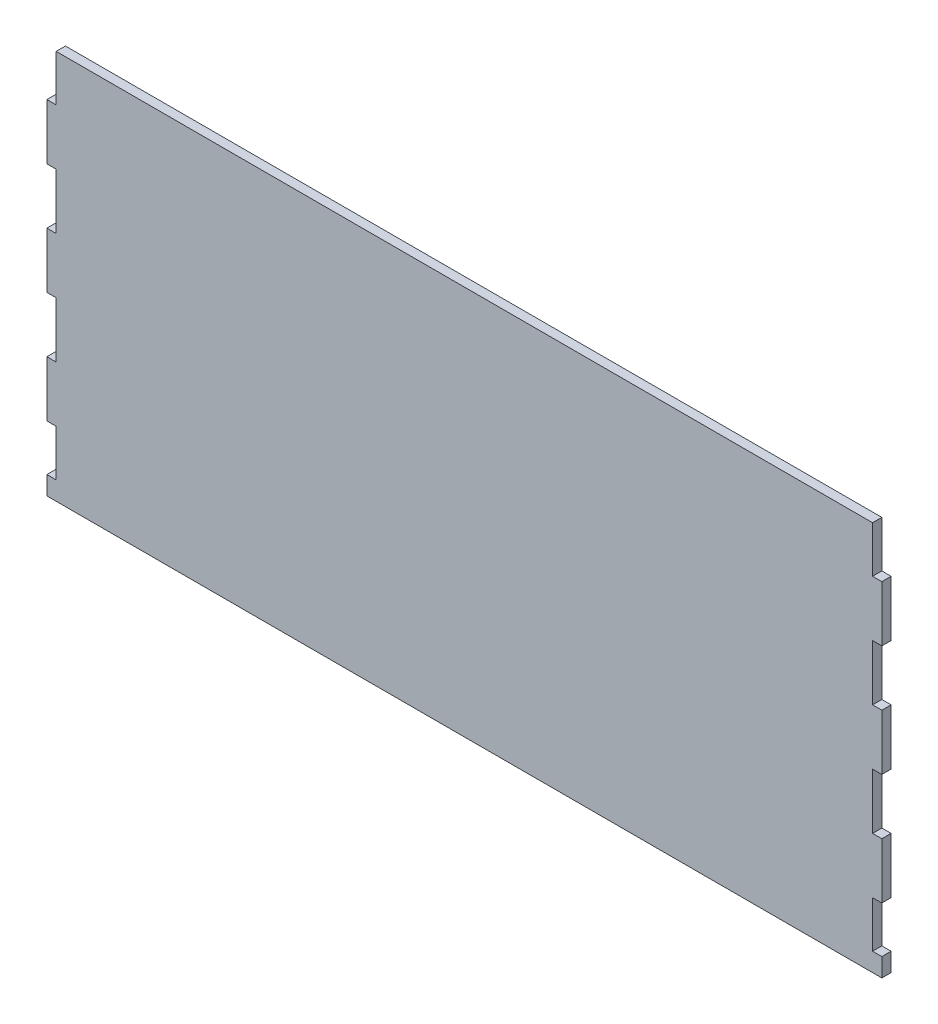
ISO-10303-21;
HEADER;
FILE_DESCRIPTION(('STEP AP214'),'2;1');
FILE_NAME('part.step','',(''),(''),'','','');
FILE_SCHEMA(('AUTOMOTIVE_DESIGN { 1 0 10303 214 1 1 1 1 }'));
ENDSEC;
DATA;
#1=APPLICATION_CONTEXT('core data for automotive mechanical design processes');
#2=APPLICATION_PROTOCOL_DEFINITION('international standard','automotive_design',2000,#1);
#3=PRODUCT_CONTEXT('',#1,'mechanical');
#4=PRODUCT('Part','Part','',(#3));
#5=PRODUCT_RELATED_PRODUCT_CATEGORY('part','',(#4));
#6=PRODUCT_DEFINITION_FORMATION('','',#4);
#7=PRODUCT_DEFINITION_CONTEXT('part definition',#1,'design');
#8=PRODUCT_DEFINITION('design','',#6,#7);
#9=PRODUCT_DEFINITION_SHAPE('','',#8);
#10=(LENGTH_UNIT() NAMED_UNIT(*) SI_UNIT(.MILLI.,.METRE.));
#11=(NAMED_UNIT(*) PLANE_ANGLE_UNIT() SI_UNIT($,.RADIAN.));
#12=(NAMED_UNIT(*) SI_UNIT($,.STERADIAN.) SOLID_ANGLE_UNIT());
#13=UNCERTAINTY_MEASURE_WITH_UNIT(LENGTH_MEASURE(1.E-05),#10,'distance_accuracy_value','');
#14=(GEOMETRIC_REPRESENTATION_CONTEXT(3) GLOBAL_UNCERTAINTY_ASSIGNED_CONTEXT((#13)) GLOBAL_UNIT_ASSIGNED_CONTEXT((#10,
#11,#12)) REPRESENTATION_CONTEXT('',''));
#15=CARTESIAN_POINT('',(0.,0.,0.));
#16=DIRECTION('',(0.,0.,1.));
#17=DIRECTION('',(1.,0.,0.));
#18=AXIS2_PLACEMENT_3D('',#15,#16,#17);
#19=CARTESIAN_POINT('',(225.,105.,5.));
#20=DIRECTION('',(-1.,0.,0.));
#21=DIRECTION('',(0.,-1.,0.));
#22=AXIS2_PLACEMENT_3D('',#19,#20,#21);
#23=PLANE('',#22);
#24=DIRECTION('',(0.,1.,0.));
#25=VECTOR('',#24,1.);
#26=CARTESIAN_POINT('',(225.,105.,0.));
#27=LINE('',#26,#25);
#28=CARTESIAN_POINT('',(225.,-105.,0.));
#29=VERTEX_POINT('',#28);
#30=CARTESIAN_POINT('',(225.,-95.,0.));
#31=VERTEX_POINT('',#30);
#32=EDGE_CURVE('E530',#29,#31,#27,.T.);
#33=ORIENTED_EDGE('',*,*,#32,.T.);
#34=DIRECTION('',(0.,0.,1.));
#35=VECTOR('',#34,1.);
#36=CARTESIAN_POINT('',(225.,-95.,5.));
#37=LINE('',#36,#35);
#38=CARTESIAN_POINT('',(225.,-95.,5.));
#39=VERTEX_POINT('',#38);
#40=EDGE_CURVE('E503',#31,#39,#37,.T.);
#41=ORIENTED_EDGE('',*,*,#40,.T.);
#42=DIRECTION('',(0.,1.,0.));
#43=VECTOR('',#42,1.);
#44=CARTESIAN_POINT('',(225.,105.,5.));
#45=LINE('',#44,#43);
#46=CARTESIAN_POINT('',(225.,-105.,5.));
#47=VERTEX_POINT('',#46);
#48=EDGE_CURVE('E512',#47,#39,#45,.T.);
#49=ORIENTED_EDGE('',*,*,#48,.F.);
#50=DIRECTION('',(0.,0.,-1.));
#51=VECTOR('',#50,1.);
#52=CARTESIAN_POINT('',(225.,-105.,5.));
#53=LINE('',#52,#51);
#54=EDGE_CURVE('E529',#47,#29,#53,.T.);
#55=ORIENTED_EDGE('',*,*,#54,.T.);
#56=EDGE_LOOP('',(#33,#41,#49,#55));
#57=FACE_BOUND('',#56,.T.);
#58=ADVANCED_FACE('F41',(#57),#23,.F.);
#59=CARTESIAN_POINT('',(225.,-70.,5.));
#60=VERTEX_POINT('',#59);
#61=CARTESIAN_POINT('',(225.,-40.,5.));
#62=VERTEX_POINT('',#61);
#63=EDGE_CURVE('E517',#60,#62,#45,.T.);
#64=ORIENTED_EDGE('',*,*,#63,.F.);
#65=DIRECTION('',(0.,0.,-1.));
#66=VECTOR('',#65,1.);
#67=CARTESIAN_POINT('',(225.,-70.,5.));
#68=LINE('',#67,#66);
#69=CARTESIAN_POINT('',(225.,-70.,0.));
#70=VERTEX_POINT('',#69);
#71=EDGE_CURVE('E499',#60,#70,#68,.T.);
#72=ORIENTED_EDGE('',*,*,#71,.T.);
#73=CARTESIAN_POINT('',(225.,-40.,0.));
#74=VERTEX_POINT('',#73);
#75=EDGE_CURVE('E535',#70,#74,#27,.T.);
#76=ORIENTED_EDGE('',*,*,#75,.T.);
#77=DIRECTION('',(0.,0.,1.));
#78=VECTOR('',#77,1.);
#79=CARTESIAN_POINT('',(225.,-40.,5.));
#80=LINE('',#79,#78);
#81=EDGE_CURVE('E495',#74,#62,#80,.T.);
#82=ORIENTED_EDGE('',*,*,#81,.T.);
#83=EDGE_LOOP('',(#64,#72,#76,#82));
#84=FACE_BOUND('',#83,.T.);
#85=ADVANCED_FACE('F583',(#84),#23,.F.);
#86=CARTESIAN_POINT('',(225.,-10.,5.));
#87=VERTEX_POINT('',#86);
#88=CARTESIAN_POINT('',(225.,20.,5.));
#89=VERTEX_POINT('',#88);
#90=EDGE_CURVE('E609',#87,#89,#45,.T.);
#91=ORIENTED_EDGE('',*,*,#90,.F.);
#92=DIRECTION('',(0.,0.,-1.));
#93=VECTOR('',#92,1.);
#94=CARTESIAN_POINT('',(225.,-10.,5.));
#95=LINE('',#94,#93);
#96=CARTESIAN_POINT('',(225.,-10.,0.));
#97=VERTEX_POINT('',#96);
#98=EDGE_CURVE('E491',#87,#97,#95,.T.);
#99=ORIENTED_EDGE('',*,*,#98,.T.);
#100=CARTESIAN_POINT('',(225.,20.,0.));
#101=VERTEX_POINT('',#100);
#102=EDGE_CURVE('E586',#97,#101,#27,.T.);
#103=ORIENTED_EDGE('',*,*,#102,.T.);
#104=DIRECTION('',(0.,0.,1.));
#105=VECTOR('',#104,1.);
#106=CARTESIAN_POINT('',(225.,20.,5.));
#107=LINE('',#106,#105);
#108=EDGE_CURVE('E487',#101,#89,#107,.T.);
#109=ORIENTED_EDGE('',*,*,#108,.T.);
#110=EDGE_LOOP('',(#91,#99,#103,#109));
#111=FACE_BOUND('',#110,.T.);
#112=ADVANCED_FACE('F692',(#111),#23,.F.);
#113=CARTESIAN_POINT('',(-225.,105.,5.));
#114=DIRECTION('',(1.,0.,0.));
#115=DIRECTION('',(0.,1.,0.));
#116=AXIS2_PLACEMENT_3D('',#113,#114,#115);
#117=PLANE('',#116);
#118=DIRECTION('',(0.,-1.,0.));
#119=VECTOR('',#118,1.);
#120=CARTESIAN_POINT('',(-225.,105.,5.));
#121=LINE('',#120,#119);
#122=CARTESIAN_POINT('',(-225.,20.,5.));
#123=VERTEX_POINT('',#122);
#124=CARTESIAN_POINT('',(-225.,-10.,5.));
#125=VERTEX_POINT('',#124);
#126=EDGE_CURVE('E666',#123,#125,#121,.T.);
#127=ORIENTED_EDGE('',*,*,#126,.F.);
#128=DIRECTION('',(0.,0.,-1.));
#129=VECTOR('',#128,1.);
#130=CARTESIAN_POINT('',(-225.,20.,5.));
#131=LINE('',#130,#129);
#132=CARTESIAN_POINT('',(-225.,20.,0.));
#133=VERTEX_POINT('',#132);
#134=EDGE_CURVE('E479',#123,#133,#131,.T.);
#135=ORIENTED_EDGE('',*,*,#134,.T.);
#136=DIRECTION('',(0.,-1.,0.));
#137=VECTOR('',#136,1.);
#138=CARTESIAN_POINT('',(-225.,105.,0.));
#139=LINE('',#138,#137);
#140=CARTESIAN_POINT('',(-225.,-10.,0.));
#141=VERTEX_POINT('',#140);
#142=EDGE_CURVE('E649',#133,#141,#139,.T.);
#143=ORIENTED_EDGE('',*,*,#142,.T.);
#144=DIRECTION('',(0.,0.,1.));
#145=VECTOR('',#144,1.);
#146=CARTESIAN_POINT('',(-225.,-10.,5.));
#147=LINE('',#146,#145);
#148=EDGE_CURVE('E468',#141,#125,#147,.T.);
#149=ORIENTED_EDGE('',*,*,#148,.T.);
#150=EDGE_LOOP('',(#127,#135,#143,#149));
#151=FACE_BOUND('',#150,.T.);
#152=ADVANCED_FACE('F664',(#151),#117,.F.);
#153=CARTESIAN_POINT('',(-225.,-40.,5.));
#154=VERTEX_POINT('',#153);
#155=CARTESIAN_POINT('',(-225.,-70.,5.));
#156=VERTEX_POINT('',#155);
#157=EDGE_CURVE('E525',#154,#156,#121,.T.);
#158=ORIENTED_EDGE('',*,*,#157,.F.);
#159=DIRECTION('',(0.,0.,-1.));
#160=VECTOR('',#159,1.);
#161=CARTESIAN_POINT('',(-225.,-40.,5.));
#162=LINE('',#161,#160);
#163=CARTESIAN_POINT('',(-225.,-40.,0.));
#164=VERTEX_POINT('',#163);
#165=EDGE_CURVE('E472',#154,#164,#162,.T.);
#166=ORIENTED_EDGE('',*,*,#165,.T.);
#167=CARTESIAN_POINT('',(-225.,-70.,0.));
#168=VERTEX_POINT('',#167);
#169=EDGE_CURVE('E542',#164,#168,#139,.T.);
#170=ORIENTED_EDGE('',*,*,#169,.T.);
#171=DIRECTION('',(0.,0.,1.));
#172=VECTOR('',#171,1.);
#173=CARTESIAN_POINT('',(-225.,-70.,5.));
#174=LINE('',#173,#172);
#175=EDGE_CURVE('E460',#168,#156,#174,.T.);
#176=ORIENTED_EDGE('',*,*,#175,.T.);
#177=EDGE_LOOP('',(#158,#166,#170,#176));
#178=FACE_BOUND('',#177,.T.);
#179=ADVANCED_FACE('F647',(#178),#117,.F.);
#180=CARTESIAN_POINT('',(-225.,-95.,5.));
#181=VERTEX_POINT('',#180);
#182=CARTESIAN_POINT('',(-225.,-105.,5.));
#183=VERTEX_POINT('',#182);
#184=EDGE_CURVE('E522',#181,#183,#121,.T.);
#185=ORIENTED_EDGE('',*,*,#184,.F.);
#186=DIRECTION('',(0.,0.,-1.));
#187=VECTOR('',#186,1.);
#188=CARTESIAN_POINT('',(-225.,-95.,5.));
#189=LINE('',#188,#187);
#190=CARTESIAN_POINT('',(-225.,-95.,0.));
#191=VERTEX_POINT('',#190);
#192=EDGE_CURVE('E464',#181,#191,#189,.T.);
#193=ORIENTED_EDGE('',*,*,#192,.T.);
#194=CARTESIAN_POINT('',(-225.,-105.,0.));
#195=VERTEX_POINT('',#194);
#196=EDGE_CURVE('E539',#191,#195,#139,.T.);
#197=ORIENTED_EDGE('',*,*,#196,.T.);
#198=DIRECTION('',(0.,0.,-1.));
#199=VECTOR('',#198,1.);
#200=CARTESIAN_POINT('',(-225.,-105.,5.));
#201=LINE('',#200,#199);
#202=EDGE_CURVE('E550',#183,#195,#201,.T.);
#203=ORIENTED_EDGE('',*,*,#202,.F.);
#204=EDGE_LOOP('',(#185,#193,#197,#203));
#205=FACE_BOUND('',#204,.T.);
#206=ADVANCED_FACE('F633',(#205),#117,.F.);
#207=CARTESIAN_POINT('',(225.,50.,5.));
#208=VERTEX_POINT('',#207);
#209=CARTESIAN_POINT('',(225.,80.,5.));
#210=VERTEX_POINT('',#209);
#211=EDGE_CURVE('E518',#208,#210,#45,.T.);
#212=ORIENTED_EDGE('',*,*,#211,.F.);
#213=DIRECTION('',(0.,0.,-1.));
#214=VECTOR('',#213,1.);
#215=CARTESIAN_POINT('',(225.,50.,5.));
#216=LINE('',#215,#214);
#217=CARTESIAN_POINT('',(225.,50.,0.));
#218=VERTEX_POINT('',#217);
#219=EDGE_CURVE('E483',#208,#218,#216,.T.);
#220=ORIENTED_EDGE('',*,*,#219,.T.);
#221=CARTESIAN_POINT('',(225.,80.,0.));
#222=VERTEX_POINT('',#221);
#223=EDGE_CURVE('E511',#218,#222,#27,.T.);
#224=ORIENTED_EDGE('',*,*,#223,.T.);
#225=DIRECTION('',(0.,0.,1.));
#226=VECTOR('',#225,1.);
#227=CARTESIAN_POINT('',(225.,80.,5.));
#228=LINE('',#227,#226);
#229=EDGE_CURVE('E453',#222,#210,#228,.T.);
#230=ORIENTED_EDGE('',*,*,#229,.T.);
#231=EDGE_LOOP('',(#212,#220,#224,#230));
#232=FACE_BOUND('',#231,.T.);
#233=ADVANCED_FACE('F43',(#232),#23,.F.);
#234=CARTESIAN_POINT('',(-225.,105.,5.));
#235=DIRECTION('',(0.,-1.,0.));
#236=DIRECTION('',(0.,0.,-1.));
#237=AXIS2_PLACEMENT_3D('',#234,#235,#236);
#238=PLANE('',#237);
#239=DIRECTION('',(-1.,0.,0.));
#240=VECTOR('',#239,1.);
#241=CARTESIAN_POINT('',(-225.,105.,0.));
#242=LINE('',#241,#240);
#243=CARTESIAN_POINT('',(220.,105.,0.));
#244=VERTEX_POINT('',#243);
#245=CARTESIAN_POINT('',(-220.,105.,0.));
#246=VERTEX_POINT('',#245);
#247=EDGE_CURVE('E534',#244,#246,#242,.T.);
#248=ORIENTED_EDGE('',*,*,#247,.T.);
#249=DIRECTION('',(0.,0.,-1.));
#250=VECTOR('',#249,1.);
#251=CARTESIAN_POINT('',(-220.,105.,5.));
#252=LINE('',#251,#250);
#253=CARTESIAN_POINT('',(-220.,105.,5.));
#254=VERTEX_POINT('',#253);
#255=EDGE_CURVE('E378',#254,#246,#252,.T.);
#256=ORIENTED_EDGE('',*,*,#255,.F.);
#257=DIRECTION('',(-1.,0.,0.));
#258=VECTOR('',#257,1.);
#259=CARTESIAN_POINT('',(-225.,105.,5.));
#260=LINE('',#259,#258);
#261=CARTESIAN_POINT('',(220.,105.,5.));
#262=VERTEX_POINT('',#261);
#263=EDGE_CURVE('E516',#262,#254,#260,.T.);
#264=ORIENTED_EDGE('',*,*,#263,.F.);
#265=DIRECTION('',(0.,0.,-1.));
#266=VECTOR('',#265,1.);
#267=CARTESIAN_POINT('',(220.,105.,5.));
#268=LINE('',#267,#266);
#269=EDGE_CURVE('E446',#262,#244,#268,.T.);
#270=ORIENTED_EDGE('',*,*,#269,.T.);
#271=EDGE_LOOP('',(#248,#256,#264,#270));
#272=FACE_BOUND('',#271,.T.);
#273=ADVANCED_FACE('F694',(#272),#238,.F.);
#274=CARTESIAN_POINT('',(-225.,80.,5.));
#275=VERTEX_POINT('',#274);
#276=CARTESIAN_POINT('',(-225.,50.,5.));
#277=VERTEX_POINT('',#276);
#278=EDGE_CURVE('E279',#275,#277,#121,.T.);
#279=ORIENTED_EDGE('',*,*,#278,.F.);
#280=DIRECTION('',(0.,0.,-1.));
#281=VECTOR('',#280,1.);
#282=CARTESIAN_POINT('',(-225.,80.,5.));
#283=LINE('',#282,#281);
#284=CARTESIAN_POINT('',(-225.,80.,0.));
#285=VERTEX_POINT('',#284);
#286=EDGE_CURVE('E507',#275,#285,#283,.T.);
#287=ORIENTED_EDGE('',*,*,#286,.T.);
#288=CARTESIAN_POINT('',(-225.,50.,0.));
#289=VERTEX_POINT('',#288);
#290=EDGE_CURVE('E543',#285,#289,#139,.T.);
#291=ORIENTED_EDGE('',*,*,#290,.T.);
#292=DIRECTION('',(0.,0.,1.));
#293=VECTOR('',#292,1.);
#294=CARTESIAN_POINT('',(-225.,50.,5.));
#295=LINE('',#294,#293);
#296=EDGE_CURVE('E476',#289,#277,#295,.T.);
#297=ORIENTED_EDGE('',*,*,#296,.T.);
#298=EDGE_LOOP('',(#279,#287,#291,#297));
#299=FACE_BOUND('',#298,.T.);
#300=ADVANCED_FACE('F657',(#299),#117,.F.);
#301=CARTESIAN_POINT('',(-225.,-105.,5.));
#302=DIRECTION('',(0.,1.,0.));
#303=DIRECTION('',(0.,0.,1.));
#304=AXIS2_PLACEMENT_3D('',#301,#302,#303);
#305=PLANE('',#304);
#306=DIRECTION('',(1.,0.,0.));
#307=VECTOR('',#306,1.);
#308=CARTESIAN_POINT('',(-225.,-105.,0.));
#309=LINE('',#308,#307);
#310=EDGE_CURVE('E544',#195,#29,#309,.T.);
#311=ORIENTED_EDGE('',*,*,#310,.T.);
#312=ORIENTED_EDGE('',*,*,#54,.F.);
#313=DIRECTION('',(1.,0.,0.));
#314=VECTOR('',#313,1.);
#315=CARTESIAN_POINT('',(-225.,-105.,5.));
#316=LINE('',#315,#314);
#317=EDGE_CURVE('E526',#183,#47,#316,.T.);
#318=ORIENTED_EDGE('',*,*,#317,.F.);
#319=ORIENTED_EDGE('',*,*,#202,.T.);
#320=EDGE_LOOP('',(#311,#312,#318,#319));
#321=FACE_BOUND('',#320,.T.);
#322=ADVANCED_FACE('F626',(#321),#305,.F.);
#323=CARTESIAN_POINT('',(0.,0.,5.));
#324=DIRECTION('',(0.,0.,1.));
#325=DIRECTION('',(1.,0.,0.));
#326=AXIS2_PLACEMENT_3D('',#323,#324,#325);
#327=PLANE('',#326);
#328=DIRECTION('',(-1.,0.,0.));
#329=VECTOR('',#328,1.);
#330=CARTESIAN_POINT('',(-220.,80.,5.));
#331=LINE('',#330,#329);
#332=CARTESIAN_POINT('',(-220.,80.,5.));
#333=VERTEX_POINT('',#332);
#334=EDGE_CURVE('E374',#333,#275,#331,.T.);
#335=ORIENTED_EDGE('',*,*,#334,.T.);
#336=ORIENTED_EDGE('',*,*,#278,.T.);
#337=DIRECTION('',(1.,0.,0.));
#338=VECTOR('',#337,1.);
#339=CARTESIAN_POINT('',(-220.,50.,5.));
#340=LINE('',#339,#338);
#341=CARTESIAN_POINT('',(-220.,50.,5.));
#342=VERTEX_POINT('',#341);
#343=EDGE_CURVE('E256',#277,#342,#340,.T.);
#344=ORIENTED_EDGE('',*,*,#343,.T.);
#345=DIRECTION('',(0.,-1.,0.));
#346=VECTOR('',#345,1.);
#347=CARTESIAN_POINT('',(-220.,50.,5.));
#348=LINE('',#347,#346);
#349=CARTESIAN_POINT('',(-220.,20.,5.));
#350=VERTEX_POINT('',#349);
#351=EDGE_CURVE('E268',#342,#350,#348,.T.);
#352=ORIENTED_EDGE('',*,*,#351,.T.);
#353=DIRECTION('',(-1.,0.,0.));
#354=VECTOR('',#353,1.);
#355=CARTESIAN_POINT('',(-220.,20.,5.));
#356=LINE('',#355,#354);
#357=EDGE_CURVE('E265',#350,#123,#356,.T.);
#358=ORIENTED_EDGE('',*,*,#357,.T.);
#359=ORIENTED_EDGE('',*,*,#126,.T.);
#360=DIRECTION('',(1.,0.,0.));
#361=VECTOR('',#360,1.);
#362=CARTESIAN_POINT('',(-220.,-10.,5.));
#363=LINE('',#362,#361);
#364=CARTESIAN_POINT('',(-220.,-10.,5.));
#365=VERTEX_POINT('',#364);
#366=EDGE_CURVE('E295',#125,#365,#363,.T.);
#367=ORIENTED_EDGE('',*,*,#366,.T.);
#368=DIRECTION('',(0.,-1.,0.));
#369=VECTOR('',#368,1.);
#370=CARTESIAN_POINT('',(-220.,-10.,5.));
#371=LINE('',#370,#369);
#372=CARTESIAN_POINT('',(-220.,-40.,5.));
#373=VERTEX_POINT('',#372);
#374=EDGE_CURVE('E299',#365,#373,#371,.T.);
#375=ORIENTED_EDGE('',*,*,#374,.T.);
#376=DIRECTION('',(-1.,0.,0.));
#377=VECTOR('',#376,1.);
#378=CARTESIAN_POINT('',(-220.,-40.,5.));
#379=LINE('',#378,#377);
#380=EDGE_CURVE('E304',#373,#154,#379,.T.);
#381=ORIENTED_EDGE('',*,*,#380,.T.);
#382=ORIENTED_EDGE('',*,*,#157,.T.);
#383=DIRECTION('',(1.,0.,0.));
#384=VECTOR('',#383,1.);
#385=CARTESIAN_POINT('',(-220.,-70.,5.));
#386=LINE('',#385,#384);
#387=CARTESIAN_POINT('',(-220.,-70.,5.));
#388=VERTEX_POINT('',#387);
#389=EDGE_CURVE('E321',#156,#388,#386,.T.);
#390=ORIENTED_EDGE('',*,*,#389,.T.);
#391=DIRECTION('',(0.,-1.,0.));
#392=VECTOR('',#391,1.);
#393=CARTESIAN_POINT('',(-220.,-95.,5.));
#394=LINE('',#393,#392);
#395=CARTESIAN_POINT('',(-220.,-95.,5.));
#396=VERTEX_POINT('',#395);
#397=EDGE_CURVE('E325',#388,#396,#394,.T.);
#398=ORIENTED_EDGE('',*,*,#397,.T.);
#399=DIRECTION('',(-1.,0.,0.));
#400=VECTOR('',#399,1.);
#401=CARTESIAN_POINT('',(-220.,-95.,5.));
#402=LINE('',#401,#400);
#403=EDGE_CURVE('E330',#396,#181,#402,.T.);
#404=ORIENTED_EDGE('',*,*,#403,.T.);
#405=ORIENTED_EDGE('',*,*,#184,.T.);
#406=ORIENTED_EDGE('',*,*,#317,.T.);
#407=ORIENTED_EDGE('',*,*,#48,.T.);
#408=DIRECTION('',(-1.,0.,0.));
#409=VECTOR('',#408,1.);
#410=CARTESIAN_POINT('',(414.707934705798,-95.,5.));
#411=LINE('',#410,#409);
#412=CARTESIAN_POINT('',(220.,-95.,5.));
#413=VERTEX_POINT('',#412);
#414=EDGE_CURVE('E355',#39,#413,#411,.T.);
#415=ORIENTED_EDGE('',*,*,#414,.T.);
#416=DIRECTION('',(0.,1.,0.));
#417=VECTOR('',#416,1.);
#418=CARTESIAN_POINT('',(220.,-95.,5.));
#419=LINE('',#418,#417);
#420=CARTESIAN_POINT('',(220.,-70.,5.));
#421=VERTEX_POINT('',#420);
#422=EDGE_CURVE('E346',#413,#421,#419,.T.);
#423=ORIENTED_EDGE('',*,*,#422,.T.);
#424=DIRECTION('',(1.,0.,0.));
#425=VECTOR('',#424,1.);
#426=CARTESIAN_POINT('',(414.707934705798,-70.,5.));
#427=LINE('',#426,#425);
#428=EDGE_CURVE('E350',#421,#60,#427,.T.);
#429=ORIENTED_EDGE('',*,*,#428,.T.);
#430=ORIENTED_EDGE('',*,*,#63,.T.);
#431=DIRECTION('',(-1.,0.,0.));
#432=VECTOR('',#431,1.);
#433=CARTESIAN_POINT('',(412.205874683252,-40.,5.));
#434=LINE('',#433,#432);
#435=CARTESIAN_POINT('',(220.,-40.,5.));
#436=VERTEX_POINT('',#435);
#437=EDGE_CURVE('E425',#62,#436,#434,.T.);
#438=ORIENTED_EDGE('',*,*,#437,.T.);
#439=DIRECTION('',(0.,1.,0.));
#440=VECTOR('',#439,1.);
#441=CARTESIAN_POINT('',(220.,-10.,5.));
#442=LINE('',#441,#440);
#443=CARTESIAN_POINT('',(220.,-10.,5.));
#444=VERTEX_POINT('',#443);
#445=EDGE_CURVE('E416',#436,#444,#442,.T.);
#446=ORIENTED_EDGE('',*,*,#445,.T.);
#447=DIRECTION('',(1.,0.,0.));
#448=VECTOR('',#447,1.);
#449=CARTESIAN_POINT('',(412.205874683252,-9.99999999999998,5.));
#450=LINE('',#449,#448);
#451=EDGE_CURVE('E420',#444,#87,#450,.T.);
#452=ORIENTED_EDGE('',*,*,#451,.T.);
#453=ORIENTED_EDGE('',*,*,#90,.T.);
#454=DIRECTION('',(-1.,0.,0.));
#455=VECTOR('',#454,1.);
#456=CARTESIAN_POINT('',(363.228691137857,20.,5.));
#457=LINE('',#456,#455);
#458=CARTESIAN_POINT('',(220.,20.,5.));
#459=VERTEX_POINT('',#458);
#460=EDGE_CURVE('E397',#89,#459,#457,.T.);
#461=ORIENTED_EDGE('',*,*,#460,.T.);
#462=DIRECTION('',(0.,1.,0.));
#463=VECTOR('',#462,1.);
#464=CARTESIAN_POINT('',(220.,50.,5.));
#465=LINE('',#464,#463);
#466=CARTESIAN_POINT('',(220.,50.,5.));
#467=VERTEX_POINT('',#466);
#468=EDGE_CURVE('E388',#459,#467,#465,.T.);
#469=ORIENTED_EDGE('',*,*,#468,.T.);
#470=DIRECTION('',(1.,0.,0.));
#471=VECTOR('',#470,1.);
#472=CARTESIAN_POINT('',(363.228691137857,50.,5.));
#473=LINE('',#472,#471);
#474=EDGE_CURVE('E392',#467,#208,#473,.T.);
#475=ORIENTED_EDGE('',*,*,#474,.T.);
#476=ORIENTED_EDGE('',*,*,#211,.T.);
#477=DIRECTION('',(-1.,0.,0.));
#478=VECTOR('',#477,1.);
#479=CARTESIAN_POINT('',(285.821391224999,80.,5.));
#480=LINE('',#479,#478);
#481=CARTESIAN_POINT('',(220.,80.,5.));
#482=VERTEX_POINT('',#481);
#483=EDGE_CURVE('E442',#210,#482,#480,.T.);
#484=ORIENTED_EDGE('',*,*,#483,.T.);
#485=DIRECTION('',(0.,1.,0.));
#486=VECTOR('',#485,1.);
#487=CARTESIAN_POINT('',(220.,105.,5.));
#488=LINE('',#487,#486);
#489=EDGE_CURVE('E438',#482,#262,#488,.T.);
#490=ORIENTED_EDGE('',*,*,#489,.T.);
#491=ORIENTED_EDGE('',*,*,#263,.T.);
#492=DIRECTION('',(0.,-1.,0.));
#493=VECTOR('',#492,1.);
#494=CARTESIAN_POINT('',(-220.,105.,5.));
#495=LINE('',#494,#493);
#496=EDGE_CURVE('E370',#254,#333,#495,.T.);
#497=ORIENTED_EDGE('',*,*,#496,.T.);
#498=EDGE_LOOP('',(#335,#336,#344,#352,#358,#359,#367,#375,#381,#382,#390,#398,#404,#405,#406,
#407,#415,#423,#429,#430,#438,#446,#452,#453,#461,#469,#475,#476,#484,#490,#491,#497));
#499=FACE_BOUND('',#498,.T.);
#500=ADVANCED_FACE('F277',(#499),#327,.T.);
#501=CARTESIAN_POINT('',(0.,0.,0.));
#502=DIRECTION('',(0.,0.,1.));
#503=DIRECTION('',(1.,0.,0.));
#504=AXIS2_PLACEMENT_3D('',#501,#502,#503);
#505=PLANE('',#504);
#506=ORIENTED_EDGE('',*,*,#290,.F.);
#507=DIRECTION('',(-1.,0.,0.));
#508=VECTOR('',#507,1.);
#509=CARTESIAN_POINT('',(-220.,80.,0.));
#510=LINE('',#509,#508);
#511=CARTESIAN_POINT('',(-220.,80.,0.));
#512=VERTEX_POINT('',#511);
#513=EDGE_CURVE('E375',#512,#285,#510,.T.);
#514=ORIENTED_EDGE('',*,*,#513,.F.);
#515=DIRECTION('',(0.,-1.,0.));
#516=VECTOR('',#515,1.);
#517=CARTESIAN_POINT('',(-220.,105.,0.));
#518=LINE('',#517,#516);
#519=EDGE_CURVE('E293',#246,#512,#518,.T.);
#520=ORIENTED_EDGE('',*,*,#519,.F.);
#521=ORIENTED_EDGE('',*,*,#247,.F.);
#522=DIRECTION('',(0.,1.,0.));
#523=VECTOR('',#522,1.);
#524=CARTESIAN_POINT('',(220.,105.,0.));
#525=LINE('',#524,#523);
#526=CARTESIAN_POINT('',(220.,80.,0.));
#527=VERTEX_POINT('',#526);
#528=EDGE_CURVE('E412',#527,#244,#525,.T.);
#529=ORIENTED_EDGE('',*,*,#528,.F.);
#530=DIRECTION('',(1.,0.,0.));
#531=VECTOR('',#530,1.);
#532=CARTESIAN_POINT('',(0.,79.9999999999999,0.));
#533=LINE('',#532,#531);
#534=EDGE_CURVE('E554',#527,#222,#533,.T.);
#535=ORIENTED_EDGE('',*,*,#534,.T.);
#536=ORIENTED_EDGE('',*,*,#223,.F.);
#537=DIRECTION('',(1.,0.,0.));
#538=VECTOR('',#537,1.);
#539=CARTESIAN_POINT('',(363.228691137857,50.,0.));
#540=LINE('',#539,#538);
#541=CARTESIAN_POINT('',(220.,50.,0.));
#542=VERTEX_POINT('',#541);
#543=EDGE_CURVE('E393',#542,#218,#540,.T.);
#544=ORIENTED_EDGE('',*,*,#543,.F.);
#545=DIRECTION('',(0.,1.,0.));
#546=VECTOR('',#545,1.);
#547=CARTESIAN_POINT('',(220.,50.,0.));
#548=LINE('',#547,#546);
#549=CARTESIAN_POINT('',(220.,20.,0.));
#550=VERTEX_POINT('',#549);
#551=EDGE_CURVE('E402',#550,#542,#548,.T.);
#552=ORIENTED_EDGE('',*,*,#551,.F.);
#553=DIRECTION('',(1.,0.,0.));
#554=VECTOR('',#553,1.);
#555=CARTESIAN_POINT('',(0.,19.9999999999999,0.));
#556=LINE('',#555,#554);
#557=EDGE_CURVE('E568',#550,#101,#556,.T.);
#558=ORIENTED_EDGE('',*,*,#557,.T.);
#559=ORIENTED_EDGE('',*,*,#102,.F.);
#560=DIRECTION('',(1.,0.,0.));
#561=VECTOR('',#560,1.);
#562=CARTESIAN_POINT('',(412.205874683252,-9.99999999999998,0.));
#563=LINE('',#562,#561);
#564=CARTESIAN_POINT('',(220.,-10.,0.));
#565=VERTEX_POINT('',#564);
#566=EDGE_CURVE('E421',#565,#97,#563,.T.);
#567=ORIENTED_EDGE('',*,*,#566,.F.);
#568=DIRECTION('',(0.,1.,0.));
#569=VECTOR('',#568,1.);
#570=CARTESIAN_POINT('',(220.,-10.,0.));
#571=LINE('',#570,#569);
#572=CARTESIAN_POINT('',(220.,-40.,0.));
#573=VERTEX_POINT('',#572);
#574=EDGE_CURVE('E65',#573,#565,#571,.T.);
#575=ORIENTED_EDGE('',*,*,#574,.F.);
#576=DIRECTION('',(1.,0.,0.));
#577=VECTOR('',#576,1.);
#578=CARTESIAN_POINT('',(0.,-40.,0.));
#579=LINE('',#578,#577);
#580=EDGE_CURVE('E50',#573,#74,#579,.T.);
#581=ORIENTED_EDGE('',*,*,#580,.T.);
#582=ORIENTED_EDGE('',*,*,#75,.F.);
#583=DIRECTION('',(1.,0.,0.));
#584=VECTOR('',#583,1.);
#585=CARTESIAN_POINT('',(414.707934705798,-70.,0.));
#586=LINE('',#585,#584);
#587=CARTESIAN_POINT('',(220.,-70.,0.));
#588=VERTEX_POINT('',#587);
#589=EDGE_CURVE('E351',#588,#70,#586,.T.);
#590=ORIENTED_EDGE('',*,*,#589,.F.);
#591=DIRECTION('',(0.,1.,0.));
#592=VECTOR('',#591,1.);
#593=CARTESIAN_POINT('',(220.,-95.,0.));
#594=LINE('',#593,#592);
#595=CARTESIAN_POINT('',(220.,-95.,0.));
#596=VERTEX_POINT('',#595);
#597=EDGE_CURVE('E57',#596,#588,#594,.T.);
#598=ORIENTED_EDGE('',*,*,#597,.F.);
#599=DIRECTION('',(1.,0.,0.));
#600=VECTOR('',#599,1.);
#601=CARTESIAN_POINT('',(0.,-95.,0.));
#602=LINE('',#601,#600);
#603=EDGE_CURVE('E11',#596,#31,#602,.T.);
#604=ORIENTED_EDGE('',*,*,#603,.T.);
#605=ORIENTED_EDGE('',*,*,#32,.F.);
#606=ORIENTED_EDGE('',*,*,#310,.F.);
#607=ORIENTED_EDGE('',*,*,#196,.F.);
#608=DIRECTION('',(-1.,0.,0.));
#609=VECTOR('',#608,1.);
#610=CARTESIAN_POINT('',(-220.,-95.,0.));
#611=LINE('',#610,#609);
#612=CARTESIAN_POINT('',(-220.,-95.,0.));
#613=VERTEX_POINT('',#612);
#614=EDGE_CURVE('E326',#613,#191,#611,.T.);
#615=ORIENTED_EDGE('',*,*,#614,.F.);
#616=DIRECTION('',(0.,-1.,0.));
#617=VECTOR('',#616,1.);
#618=CARTESIAN_POINT('',(-220.,-95.,0.));
#619=LINE('',#618,#617);
#620=CARTESIAN_POINT('',(-220.,-70.,0.));
#621=VERTEX_POINT('',#620);
#622=EDGE_CURVE('E335',#621,#613,#619,.T.);
#623=ORIENTED_EDGE('',*,*,#622,.F.);
#624=DIRECTION('',(-1.,0.,0.));
#625=VECTOR('',#624,1.);
#626=CARTESIAN_POINT('',(0.,-70.,0.));
#627=LINE('',#626,#625);
#628=EDGE_CURVE('E558',#621,#168,#627,.T.);
#629=ORIENTED_EDGE('',*,*,#628,.T.);
#630=ORIENTED_EDGE('',*,*,#169,.F.);
#631=DIRECTION('',(-1.,0.,0.));
#632=VECTOR('',#631,1.);
#633=CARTESIAN_POINT('',(-220.,-40.,0.));
#634=LINE('',#633,#632);
#635=CARTESIAN_POINT('',(-220.,-40.,0.));
#636=VERTEX_POINT('',#635);
#637=EDGE_CURVE('E300',#636,#164,#634,.T.);
#638=ORIENTED_EDGE('',*,*,#637,.F.);
#639=DIRECTION('',(0.,-1.,0.));
#640=VECTOR('',#639,1.);
#641=CARTESIAN_POINT('',(-220.,-10.,0.));
#642=LINE('',#641,#640);
#643=CARTESIAN_POINT('',(-220.,-10.,0.));
#644=VERTEX_POINT('',#643);
#645=EDGE_CURVE('E309',#644,#636,#642,.T.);
#646=ORIENTED_EDGE('',*,*,#645,.F.);
#647=DIRECTION('',(-1.,0.,0.));
#648=VECTOR('',#647,1.);
#649=CARTESIAN_POINT('',(0.,-10.,0.));
#650=LINE('',#649,#648);
#651=EDGE_CURVE('E562',#644,#141,#650,.T.);
#652=ORIENTED_EDGE('',*,*,#651,.T.);
#653=ORIENTED_EDGE('',*,*,#142,.F.);
#654=DIRECTION('',(-1.,0.,0.));
#655=VECTOR('',#654,1.);
#656=CARTESIAN_POINT('',(-220.,20.,0.));
#657=LINE('',#656,#655);
#658=CARTESIAN_POINT('',(-220.,20.,0.));
#659=VERTEX_POINT('',#658);
#660=EDGE_CURVE('E281',#659,#133,#657,.T.);
#661=ORIENTED_EDGE('',*,*,#660,.F.);
#662=DIRECTION('',(0.,-1.,0.));
#663=VECTOR('',#662,1.);
#664=CARTESIAN_POINT('',(-220.,50.,0.));
#665=LINE('',#664,#663);
#666=CARTESIAN_POINT('',(-220.,50.,0.));
#667=VERTEX_POINT('',#666);
#668=EDGE_CURVE('E284',#667,#659,#665,.T.);
#669=ORIENTED_EDGE('',*,*,#668,.F.);
#670=DIRECTION('',(-1.,0.,0.));
#671=VECTOR('',#670,1.);
#672=CARTESIAN_POINT('',(0.,50.,0.));
#673=LINE('',#672,#671);
#674=EDGE_CURVE('E259',#667,#289,#673,.T.);
#675=ORIENTED_EDGE('',*,*,#674,.T.);
#676=EDGE_LOOP('',(#506,#514,#520,#521,#529,#535,#536,#544,#552,#558,#559,#567,#575,#581,#582,
#590,#598,#604,#605,#606,#607,#615,#623,#629,#630,#638,#646,#652,#653,#661,#669,#675));
#677=FACE_BOUND('',#676,.T.);
#678=ADVANCED_FACE('F577',(#677),#505,.F.);
#679=CARTESIAN_POINT('',(285.821391224999,80.,5.));
#680=DIRECTION('',(0.,-1.,0.));
#681=DIRECTION('',(1.,0.,0.));
#682=AXIS2_PLACEMENT_3D('',#679,#680,#681);
#683=PLANE('',#682);
#684=ORIENTED_EDGE('',*,*,#534,.F.);
#685=DIRECTION('',(0.,0.,-1.));
#686=VECTOR('',#685,1.);
#687=CARTESIAN_POINT('',(220.,80.,5.));
#688=LINE('',#687,#686);
#689=EDGE_CURVE('E449',#482,#527,#688,.T.);
#690=ORIENTED_EDGE('',*,*,#689,.F.);
#691=ORIENTED_EDGE('',*,*,#483,.F.);
#692=ORIENTED_EDGE('',*,*,#229,.F.);
#693=EDGE_LOOP('',(#684,#690,#691,#692));
#694=FACE_BOUND('',#693,.T.);
#695=ADVANCED_FACE('F602',(#694),#683,.F.);
#696=CARTESIAN_POINT('',(220.,105.,5.));
#697=DIRECTION('',(-1.,0.,0.));
#698=DIRECTION('',(0.,0.,1.));
#699=AXIS2_PLACEMENT_3D('',#696,#697,#698);
#700=PLANE('',#699);
#701=ORIENTED_EDGE('',*,*,#528,.T.);
#702=ORIENTED_EDGE('',*,*,#269,.F.);
#703=ORIENTED_EDGE('',*,*,#489,.F.);
#704=ORIENTED_EDGE('',*,*,#689,.T.);
#705=EDGE_LOOP('',(#701,#702,#703,#704));
#706=FACE_BOUND('',#705,.T.);
#707=ADVANCED_FACE('F605',(#706),#700,.F.);
#708=CARTESIAN_POINT('',(-220.,-95.,5.));
#709=DIRECTION('',(0.,-1.,0.));
#710=DIRECTION('',(0.,0.,-1.));
#711=AXIS2_PLACEMENT_3D('',#708,#709,#710);
#712=PLANE('',#711);
#713=ORIENTED_EDGE('',*,*,#403,.F.);
#714=DIRECTION('',(0.,0.,-1.));
#715=VECTOR('',#714,1.);
#716=CARTESIAN_POINT('',(-220.,-95.,5.));
#717=LINE('',#716,#715);
#718=EDGE_CURVE('E313',#396,#613,#717,.T.);
#719=ORIENTED_EDGE('',*,*,#718,.T.);
#720=ORIENTED_EDGE('',*,*,#614,.T.);
#721=ORIENTED_EDGE('',*,*,#192,.F.);
#722=EDGE_LOOP('',(#713,#719,#720,#721));
#723=FACE_BOUND('',#722,.T.);
#724=ADVANCED_FACE('F636',(#723),#712,.F.);
#725=CARTESIAN_POINT('',(-220.,-70.,5.));
#726=DIRECTION('',(0.,1.,0.));
#727=DIRECTION('',(0.,0.,1.));
#728=AXIS2_PLACEMENT_3D('',#725,#726,#727);
#729=PLANE('',#728);
#730=ORIENTED_EDGE('',*,*,#628,.F.);
#731=DIRECTION('',(0.,0.,-1.));
#732=VECTOR('',#731,1.);
#733=CARTESIAN_POINT('',(-220.,-70.,5.));
#734=LINE('',#733,#732);
#735=EDGE_CURVE('E334',#388,#621,#734,.T.);
#736=ORIENTED_EDGE('',*,*,#735,.F.);
#737=ORIENTED_EDGE('',*,*,#389,.F.);
#738=ORIENTED_EDGE('',*,*,#175,.F.);
#739=EDGE_LOOP('',(#730,#736,#737,#738));
#740=FACE_BOUND('',#739,.T.);
#741=ADVANCED_FACE('F773',(#740),#729,.F.);
#742=CARTESIAN_POINT('',(-220.,-95.,5.));
#743=DIRECTION('',(1.,0.,0.));
#744=DIRECTION('',(0.,0.,-1.));
#745=AXIS2_PLACEMENT_3D('',#742,#743,#744);
#746=PLANE('',#745);
#747=ORIENTED_EDGE('',*,*,#622,.T.);
#748=ORIENTED_EDGE('',*,*,#718,.F.);
#749=ORIENTED_EDGE('',*,*,#397,.F.);
#750=ORIENTED_EDGE('',*,*,#735,.T.);
#751=EDGE_LOOP('',(#747,#748,#749,#750));
#752=FACE_BOUND('',#751,.T.);
#753=ADVANCED_FACE('F640',(#752),#746,.F.);
#754=CARTESIAN_POINT('',(-220.,-40.,5.));
#755=DIRECTION('',(0.,-1.,0.));
#756=DIRECTION('',(0.,0.,-1.));
#757=AXIS2_PLACEMENT_3D('',#754,#755,#756);
#758=PLANE('',#757);
#759=ORIENTED_EDGE('',*,*,#380,.F.);
#760=DIRECTION('',(0.,0.,-1.));
#761=VECTOR('',#760,1.);
#762=CARTESIAN_POINT('',(-220.,-40.,5.));
#763=LINE('',#762,#761);
#764=EDGE_CURVE('E290',#373,#636,#763,.T.);
#765=ORIENTED_EDGE('',*,*,#764,.T.);
#766=ORIENTED_EDGE('',*,*,#637,.T.);
#767=ORIENTED_EDGE('',*,*,#165,.F.);
#768=EDGE_LOOP('',(#759,#765,#766,#767));
#769=FACE_BOUND('',#768,.T.);
#770=ADVANCED_FACE('F673',(#769),#758,.F.);
#771=CARTESIAN_POINT('',(-220.,-10.,5.));
#772=DIRECTION('',(0.,1.,0.));
#773=DIRECTION('',(0.,0.,1.));
#774=AXIS2_PLACEMENT_3D('',#771,#772,#773);
#775=PLANE('',#774);
#776=ORIENTED_EDGE('',*,*,#651,.F.);
#777=DIRECTION('',(0.,0.,-1.));
#778=VECTOR('',#777,1.);
#779=CARTESIAN_POINT('',(-220.,-10.,5.));
#780=LINE('',#779,#778);
#781=EDGE_CURVE('E308',#365,#644,#780,.T.);
#782=ORIENTED_EDGE('',*,*,#781,.F.);
#783=ORIENTED_EDGE('',*,*,#366,.F.);
#784=ORIENTED_EDGE('',*,*,#148,.F.);
#785=EDGE_LOOP('',(#776,#782,#783,#784));
#786=FACE_BOUND('',#785,.T.);
#787=ADVANCED_FACE('F678',(#786),#775,.F.);
#788=CARTESIAN_POINT('',(-220.,-10.,5.));
#789=DIRECTION('',(1.,0.,0.));
#790=DIRECTION('',(0.,0.,-1.));
#791=AXIS2_PLACEMENT_3D('',#788,#789,#790);
#792=PLANE('',#791);
#793=ORIENTED_EDGE('',*,*,#645,.T.);
#794=ORIENTED_EDGE('',*,*,#764,.F.);
#795=ORIENTED_EDGE('',*,*,#374,.F.);
#796=ORIENTED_EDGE('',*,*,#781,.T.);
#797=EDGE_LOOP('',(#793,#794,#795,#796));
#798=FACE_BOUND('',#797,.T.);
#799=ADVANCED_FACE('F676',(#798),#792,.F.);
#800=CARTESIAN_POINT('',(-220.,20.,5.));
#801=DIRECTION('',(0.,-1.,0.));
#802=DIRECTION('',(0.,0.,-1.));
#803=AXIS2_PLACEMENT_3D('',#800,#801,#802);
#804=PLANE('',#803);
#805=ORIENTED_EDGE('',*,*,#357,.F.);
#806=DIRECTION('',(0.,0.,-1.));
#807=VECTOR('',#806,1.);
#808=CARTESIAN_POINT('',(-220.,20.,5.));
#809=LINE('',#808,#807);
#810=EDGE_CURVE('E264',#350,#659,#809,.T.);
#811=ORIENTED_EDGE('',*,*,#810,.T.);
#812=ORIENTED_EDGE('',*,*,#660,.T.);
#813=ORIENTED_EDGE('',*,*,#134,.F.);
#814=EDGE_LOOP('',(#805,#811,#812,#813));
#815=FACE_BOUND('',#814,.T.);
#816=ADVANCED_FACE('F662',(#815),#804,.F.);
#817=CARTESIAN_POINT('',(-220.,50.,5.));
#818=DIRECTION('',(0.,1.,0.));
#819=DIRECTION('',(0.,0.,1.));
#820=AXIS2_PLACEMENT_3D('',#817,#818,#819);
#821=PLANE('',#820);
#822=ORIENTED_EDGE('',*,*,#674,.F.);
#823=DIRECTION('',(0.,0.,-1.));
#824=VECTOR('',#823,1.);
#825=CARTESIAN_POINT('',(-220.,50.,5.));
#826=LINE('',#825,#824);
#827=EDGE_CURVE('E252',#342,#667,#826,.T.);
#828=ORIENTED_EDGE('',*,*,#827,.F.);
#829=ORIENTED_EDGE('',*,*,#343,.F.);
#830=ORIENTED_EDGE('',*,*,#296,.F.);
#831=EDGE_LOOP('',(#822,#828,#829,#830));
#832=FACE_BOUND('',#831,.T.);
#833=ADVANCED_FACE('F254',(#832),#821,.F.);
#834=CARTESIAN_POINT('',(-220.,50.,5.));
#835=DIRECTION('',(1.,0.,0.));
#836=DIRECTION('',(0.,0.,-1.));
#837=AXIS2_PLACEMENT_3D('',#834,#835,#836);
#838=PLANE('',#837);
#839=ORIENTED_EDGE('',*,*,#668,.T.);
#840=ORIENTED_EDGE('',*,*,#810,.F.);
#841=ORIENTED_EDGE('',*,*,#351,.F.);
#842=ORIENTED_EDGE('',*,*,#827,.T.);
#843=EDGE_LOOP('',(#839,#840,#841,#842));
#844=FACE_BOUND('',#843,.T.);
#845=ADVANCED_FACE('F269',(#844),#838,.F.);
#846=CARTESIAN_POINT('',(363.228691137857,20.,5.));
#847=DIRECTION('',(0.,-1.,0.));
#848=DIRECTION('',(1.,0.,0.));
#849=AXIS2_PLACEMENT_3D('',#846,#847,#848);
#850=PLANE('',#849);
#851=ORIENTED_EDGE('',*,*,#557,.F.);
#852=DIRECTION('',(0.,0.,-1.));
#853=VECTOR('',#852,1.);
#854=CARTESIAN_POINT('',(220.,20.,5.));
#855=LINE('',#854,#853);
#856=EDGE_CURVE('E408',#459,#550,#855,.T.);
#857=ORIENTED_EDGE('',*,*,#856,.F.);
#858=ORIENTED_EDGE('',*,*,#460,.F.);
#859=ORIENTED_EDGE('',*,*,#108,.F.);
#860=EDGE_LOOP('',(#851,#857,#858,#859));
#861=FACE_BOUND('',#860,.T.);
#862=ADVANCED_FACE('F706',(#861),#850,.F.);
#863=CARTESIAN_POINT('',(363.228691137857,50.,5.));
#864=DIRECTION('',(0.,1.,0.));
#865=DIRECTION('',(-1.,0.,0.));
#866=AXIS2_PLACEMENT_3D('',#863,#864,#865);
#867=PLANE('',#866);
#868=ORIENTED_EDGE('',*,*,#474,.F.);
#869=DIRECTION('',(0.,0.,-1.));
#870=VECTOR('',#869,1.);
#871=CARTESIAN_POINT('',(220.,50.,5.));
#872=LINE('',#871,#870);
#873=EDGE_CURVE('E401',#467,#542,#872,.T.);
#874=ORIENTED_EDGE('',*,*,#873,.T.);
#875=ORIENTED_EDGE('',*,*,#543,.T.);
#876=ORIENTED_EDGE('',*,*,#219,.F.);
#877=EDGE_LOOP('',(#868,#874,#875,#876));
#878=FACE_BOUND('',#877,.T.);
#879=ADVANCED_FACE('F711',(#878),#867,.F.);
#880=CARTESIAN_POINT('',(220.,50.,5.));
#881=DIRECTION('',(-1.,0.,0.));
#882=DIRECTION('',(0.,0.,1.));
#883=AXIS2_PLACEMENT_3D('',#880,#881,#882);
#884=PLANE('',#883);
#885=ORIENTED_EDGE('',*,*,#551,.T.);
#886=ORIENTED_EDGE('',*,*,#873,.F.);
#887=ORIENTED_EDGE('',*,*,#468,.F.);
#888=ORIENTED_EDGE('',*,*,#856,.T.);
#889=EDGE_LOOP('',(#885,#886,#887,#888));
#890=FACE_BOUND('',#889,.T.);
#891=ADVANCED_FACE('F708',(#890),#884,.F.);
#892=CARTESIAN_POINT('',(412.205874683252,-40.,5.));
#893=DIRECTION('',(0.,-1.,0.));
#894=DIRECTION('',(1.,0.,0.));
#895=AXIS2_PLACEMENT_3D('',#892,#893,#894);
#896=PLANE('',#895);
#897=ORIENTED_EDGE('',*,*,#580,.F.);
#898=DIRECTION('',(0.,0.,-1.));
#899=VECTOR('',#898,1.);
#900=CARTESIAN_POINT('',(220.,-40.,5.));
#901=LINE('',#900,#899);
#902=EDGE_CURVE('E405',#436,#573,#901,.T.);
#903=ORIENTED_EDGE('',*,*,#902,.F.);
#904=ORIENTED_EDGE('',*,*,#437,.F.);
#905=ORIENTED_EDGE('',*,*,#81,.F.);
#906=EDGE_LOOP('',(#897,#903,#904,#905));
#907=FACE_BOUND('',#906,.T.);
#908=ADVANCED_FACE('F718',(#907),#896,.F.);
#909=CARTESIAN_POINT('',(412.205874683252,-9.99999999999998,5.));
#910=DIRECTION('',(0.,1.,0.));
#911=DIRECTION('',(-1.,0.,0.));
#912=AXIS2_PLACEMENT_3D('',#909,#910,#911);
#913=PLANE('',#912);
#914=ORIENTED_EDGE('',*,*,#451,.F.);
#915=DIRECTION('',(0.,0.,-1.));
#916=VECTOR('',#915,1.);
#917=CARTESIAN_POINT('',(220.,-10.,5.));
#918=LINE('',#917,#916);
#919=EDGE_CURVE('E429',#444,#565,#918,.T.);
#920=ORIENTED_EDGE('',*,*,#919,.T.);
#921=ORIENTED_EDGE('',*,*,#566,.T.);
#922=ORIENTED_EDGE('',*,*,#98,.F.);
#923=EDGE_LOOP('',(#914,#920,#921,#922));
#924=FACE_BOUND('',#923,.T.);
#925=ADVANCED_FACE('F725',(#924),#913,.F.);
#926=CARTESIAN_POINT('',(220.,-10.,5.));
#927=DIRECTION('',(-1.,0.,0.));
#928=DIRECTION('',(0.,0.,1.));
#929=AXIS2_PLACEMENT_3D('',#926,#927,#928);
#930=PLANE('',#929);
#931=ORIENTED_EDGE('',*,*,#574,.T.);
#932=ORIENTED_EDGE('',*,*,#919,.F.);
#933=ORIENTED_EDGE('',*,*,#445,.F.);
#934=ORIENTED_EDGE('',*,*,#902,.T.);
#935=EDGE_LOOP('',(#931,#932,#933,#934));
#936=FACE_BOUND('',#935,.T.);
#937=ADVANCED_FACE('F728',(#936),#930,.F.);
#938=CARTESIAN_POINT('',(414.707934705798,-95.,5.));
#939=DIRECTION('',(0.,-1.,0.));
#940=DIRECTION('',(1.,0.,0.));
#941=AXIS2_PLACEMENT_3D('',#938,#939,#940);
#942=PLANE('',#941);
#943=ORIENTED_EDGE('',*,*,#603,.F.);
#944=DIRECTION('',(0.,0.,-1.));
#945=VECTOR('',#944,1.);
#946=CARTESIAN_POINT('',(220.,-95.,5.));
#947=LINE('',#946,#945);
#948=EDGE_CURVE('E365',#413,#596,#947,.T.);
#949=ORIENTED_EDGE('',*,*,#948,.F.);
#950=ORIENTED_EDGE('',*,*,#414,.F.);
#951=ORIENTED_EDGE('',*,*,#40,.F.);
#952=EDGE_LOOP('',(#943,#949,#950,#951));
#953=FACE_BOUND('',#952,.T.);
#954=ADVANCED_FACE('F732',(#953),#942,.F.);
#955=CARTESIAN_POINT('',(414.707934705798,-70.,5.));
#956=DIRECTION('',(0.,1.,0.));
#957=DIRECTION('',(-1.,0.,0.));
#958=AXIS2_PLACEMENT_3D('',#955,#956,#957);
#959=PLANE('',#958);
#960=ORIENTED_EDGE('',*,*,#428,.F.);
#961=DIRECTION('',(0.,0.,-1.));
#962=VECTOR('',#961,1.);
#963=CARTESIAN_POINT('',(220.,-70.,5.));
#964=LINE('',#963,#962);
#965=EDGE_CURVE('E359',#421,#588,#964,.T.);
#966=ORIENTED_EDGE('',*,*,#965,.T.);
#967=ORIENTED_EDGE('',*,*,#589,.T.);
#968=ORIENTED_EDGE('',*,*,#71,.F.);
#969=EDGE_LOOP('',(#960,#966,#967,#968));
#970=FACE_BOUND('',#969,.T.);
#971=ADVANCED_FACE('F617',(#970),#959,.F.);
#972=CARTESIAN_POINT('',(220.,-95.,5.));
#973=DIRECTION('',(-1.,0.,0.));
#974=DIRECTION('',(0.,0.,1.));
#975=AXIS2_PLACEMENT_3D('',#972,#973,#974);
#976=PLANE('',#975);
#977=ORIENTED_EDGE('',*,*,#597,.T.);
#978=ORIENTED_EDGE('',*,*,#965,.F.);
#979=ORIENTED_EDGE('',*,*,#422,.F.);
#980=ORIENTED_EDGE('',*,*,#948,.T.);
#981=EDGE_LOOP('',(#977,#978,#979,#980));
#982=FACE_BOUND('',#981,.T.);
#983=ADVANCED_FACE('F874',(#982),#976,.F.);
#984=CARTESIAN_POINT('',(-220.,80.,5.));
#985=DIRECTION('',(0.,-1.,0.));
#986=DIRECTION('',(0.,0.,-1.));
#987=AXIS2_PLACEMENT_3D('',#984,#985,#986);
#988=PLANE('',#987);
#989=ORIENTED_EDGE('',*,*,#334,.F.);
#990=DIRECTION('',(0.,0.,-1.));
#991=VECTOR('',#990,1.);
#992=CARTESIAN_POINT('',(-220.,80.,5.));
#993=LINE('',#992,#991);
#994=EDGE_CURVE('E362',#333,#512,#993,.T.);
#995=ORIENTED_EDGE('',*,*,#994,.T.);
#996=ORIENTED_EDGE('',*,*,#513,.T.);
#997=ORIENTED_EDGE('',*,*,#286,.F.);
#998=EDGE_LOOP('',(#989,#995,#996,#997));
#999=FACE_BOUND('',#998,.T.);
#1000=ADVANCED_FACE('F883',(#999),#988,.F.);
#1001=CARTESIAN_POINT('',(-220.,105.,5.));
#1002=DIRECTION('',(1.,0.,0.));
#1003=DIRECTION('',(0.,0.,-1.));
#1004=AXIS2_PLACEMENT_3D('',#1001,#1002,#1003);
#1005=PLANE('',#1004);
#1006=ORIENTED_EDGE('',*,*,#519,.T.);
#1007=ORIENTED_EDGE('',*,*,#994,.F.);
#1008=ORIENTED_EDGE('',*,*,#496,.F.);
#1009=ORIENTED_EDGE('',*,*,#255,.T.);
#1010=EDGE_LOOP('',(#1006,#1007,#1008,#1009));
#1011=FACE_BOUND('',#1010,.T.);
#1012=ADVANCED_FACE('F892',(#1011),#1005,.F.);
#1013=CLOSED_SHELL('',(#58,#85,#112,#152,#179,#206,#233,#273,#300,#322,#500,#678,#695,#707,#724,
#741,#753,#770,#787,#799,#816,#833,#845,#862,#879,#891,#908,#925,#937,#954,#971,#983,#1000,#1012));
#1014=MANIFOLD_SOLID_BREP('B2',#1013);
#1015=ADVANCED_BREP_SHAPE_REPRESENTATION('',(#18,#1014),#14);
#1016=SHAPE_DEFINITION_REPRESENTATION(#9,#1015);
ENDSEC;
END-ISO-10303-21;
